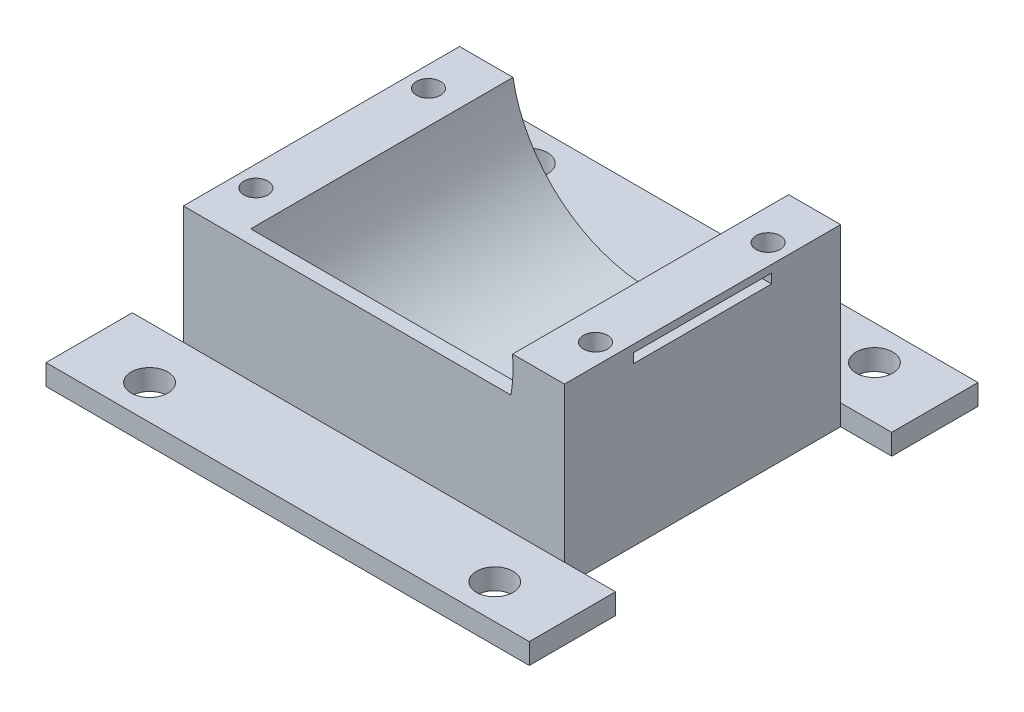
ISO-10303-21;
HEADER;
FILE_DESCRIPTION(('STEP AP214'),'2;1');
FILE_NAME('part.step','',(''),(''),'','','');
FILE_SCHEMA(('AUTOMOTIVE_DESIGN { 1 0 10303 214 1 1 1 1 }'));
ENDSEC;
DATA;
#1=APPLICATION_CONTEXT('core data for automotive mechanical design processes');
#2=APPLICATION_PROTOCOL_DEFINITION('international standard','automotive_design',2000,#1);
#3=PRODUCT_CONTEXT('',#1,'mechanical');
#4=PRODUCT('Part','Part','',(#3));
#5=PRODUCT_RELATED_PRODUCT_CATEGORY('part','',(#4));
#6=PRODUCT_DEFINITION_FORMATION('','',#4);
#7=PRODUCT_DEFINITION_CONTEXT('part definition',#1,'design');
#8=PRODUCT_DEFINITION('design','',#6,#7);
#9=PRODUCT_DEFINITION_SHAPE('','',#8);
#10=(LENGTH_UNIT() NAMED_UNIT(*) SI_UNIT(.MILLI.,.METRE.));
#11=(NAMED_UNIT(*) PLANE_ANGLE_UNIT() SI_UNIT($,.RADIAN.));
#12=(NAMED_UNIT(*) SI_UNIT($,.STERADIAN.) SOLID_ANGLE_UNIT());
#13=UNCERTAINTY_MEASURE_WITH_UNIT(LENGTH_MEASURE(1.E-05),#10,'distance_accuracy_value','');
#14=(GEOMETRIC_REPRESENTATION_CONTEXT(3) GLOBAL_UNCERTAINTY_ASSIGNED_CONTEXT((#13)) GLOBAL_UNIT_ASSIGNED_CONTEXT((#10,
#11,#12)) REPRESENTATION_CONTEXT('',''));
#15=CARTESIAN_POINT('',(0.,0.,0.));
#16=DIRECTION('',(0.,0.,1.));
#17=DIRECTION('',(1.,0.,0.));
#18=AXIS2_PLACEMENT_3D('',#15,#16,#17);
#19=CARTESIAN_POINT('',(0.,0.,-50.8));
#20=DIRECTION('',(0.,0.,1.));
#21=DIRECTION('',(1.,0.,0.));
#22=AXIS2_PLACEMENT_3D('',#19,#20,#21);
#23=PLANE('',#22);
#24=DIRECTION('',(1.,0.,0.));
#25=VECTOR('',#24,1.);
#26=CARTESIAN_POINT('',(-88.9,-52.324,-50.8));
#27=LINE('',#26,#25);
#28=CARTESIAN_POINT('',(-70.104,-52.324,-50.8));
#29=VERTEX_POINT('',#28);
#30=CARTESIAN_POINT('',(70.104,-52.324,-50.8));
#31=VERTEX_POINT('',#30);
#32=EDGE_CURVE('E11',#29,#31,#27,.T.);
#33=ORIENTED_EDGE('',*,*,#32,.F.);
#34=DIRECTION('',(0.,-1.,0.));
#35=VECTOR('',#34,1.);
#36=CARTESIAN_POINT('',(-70.104,0.,-50.8));
#37=LINE('',#36,#35);
#38=CARTESIAN_POINT('',(-70.104,-8.89148128126936,-50.8));
#39=VERTEX_POINT('',#38);
#40=EDGE_CURVE('E367',#39,#29,#37,.T.);
#41=ORIENTED_EDGE('',*,*,#40,.F.);
#42=DIRECTION('',(-1.,0.,0.));
#43=VECTOR('',#42,1.);
#44=CARTESIAN_POINT('',(0.,-8.89148128126934,-50.8));
#45=LINE('',#44,#43);
#46=CARTESIAN_POINT('',(-50.426096139936,-8.89148128126936,-50.8));
#47=VERTEX_POINT('',#46);
#48=EDGE_CURVE('E382',#47,#39,#45,.T.);
#49=ORIENTED_EDGE('',*,*,#48,.F.);
#50=CARTESIAN_POINT('',(0.,0.,-50.8));
#51=DIRECTION('',(0.,0.,1.));
#52=DIRECTION('',(1.,0.,0.));
#53=AXIS2_PLACEMENT_3D('',#50,#51,#52);
#54=CIRCLE('',#53,51.203999954);
#55=CARTESIAN_POINT('',(51.0091532752648,4.46272264764193,-50.8));
#56=VERTEX_POINT('',#55);
#57=EDGE_CURVE('E379',#47,#56,#54,.T.);
#58=ORIENTED_EDGE('',*,*,#57,.T.);
#59=DIRECTION('',(1.,0.,0.));
#60=VECTOR('',#59,1.);
#61=CARTESIAN_POINT('',(0.,4.46272264764193,-50.8));
#62=LINE('',#61,#60);
#63=CARTESIAN_POINT('',(70.104,4.46272264764193,-50.8));
#64=VERTEX_POINT('',#63);
#65=EDGE_CURVE('E376',#56,#64,#62,.T.);
#66=ORIENTED_EDGE('',*,*,#65,.T.);
#67=DIRECTION('',(0.,-1.,0.));
#68=VECTOR('',#67,1.);
#69=CARTESIAN_POINT('',(70.104,0.,-50.8));
#70=LINE('',#69,#68);
#71=EDGE_CURVE('E373',#64,#31,#70,.T.);
#72=ORIENTED_EDGE('',*,*,#71,.T.);
#73=EDGE_LOOP('',(#33,#41,#49,#58,#66,#72));
#74=FACE_BOUND('',#73,.T.);
#75=ADVANCED_FACE('F47',(#74),#23,.F.);
#76=CARTESIAN_POINT('',(0.,-52.324,0.));
#77=DIRECTION('',(0.,-1.,0.));
#78=DIRECTION('',(0.,0.,-1.));
#79=AXIS2_PLACEMENT_3D('',#76,#77,#78);
#80=PLANE('',#79);
#81=CARTESIAN_POINT('',(-63.5,-52.324,69.85));
#82=DIRECTION('',(0.,1.,0.));
#83=DIRECTION('',(0.,0.,1.));
#84=AXIS2_PLACEMENT_3D('',#81,#82,#83);
#85=CIRCLE('',#84,6.74623999999999);
#86=CARTESIAN_POINT('',(-63.5,-52.324,76.59624));
#87=VERTEX_POINT('',#86);
#88=EDGE_CURVE('E292',#87,#87,#85,.T.);
#89=ORIENTED_EDGE('',*,*,#88,.F.);
#90=EDGE_LOOP('',(#89));
#91=FACE_BOUND('',#90,.T.);
#92=DIRECTION('',(0.,0.,-1.));
#93=VECTOR('',#92,1.);
#94=CARTESIAN_POINT('',(-88.9,-52.324,82.55));
#95=LINE('',#94,#93);
#96=CARTESIAN_POINT('',(-88.9,-52.324,82.55));
#97=VERTEX_POINT('',#96);
#98=CARTESIAN_POINT('',(-88.9,-52.324,50.8));
#99=VERTEX_POINT('',#98);
#100=EDGE_CURVE('E320',#97,#99,#95,.T.);
#101=ORIENTED_EDGE('',*,*,#100,.F.);
#102=DIRECTION('',(-1.,0.,0.));
#103=VECTOR('',#102,1.);
#104=CARTESIAN_POINT('',(-88.9,-52.324,82.55));
#105=LINE('',#104,#103);
#106=CARTESIAN_POINT('',(88.9,-52.324,82.55));
#107=VERTEX_POINT('',#106);
#108=EDGE_CURVE('E334',#107,#97,#105,.T.);
#109=ORIENTED_EDGE('',*,*,#108,.F.);
#110=DIRECTION('',(0.,0.,1.));
#111=VECTOR('',#110,1.);
#112=CARTESIAN_POINT('',(88.9,-52.324,82.55));
#113=LINE('',#112,#111);
#114=CARTESIAN_POINT('',(88.9,-52.324,50.8));
#115=VERTEX_POINT('',#114);
#116=EDGE_CURVE('E330',#115,#107,#113,.T.);
#117=ORIENTED_EDGE('',*,*,#116,.F.);
#118=DIRECTION('',(1.,0.,0.));
#119=VECTOR('',#118,1.);
#120=CARTESIAN_POINT('',(-88.9,-52.324,50.8));
#121=LINE('',#120,#119);
#122=CARTESIAN_POINT('',(70.104,-52.324,50.8));
#123=VERTEX_POINT('',#122);
#124=EDGE_CURVE('E324',#123,#115,#121,.T.);
#125=ORIENTED_EDGE('',*,*,#124,.F.);
#126=CARTESIAN_POINT('',(-70.104,-52.324,50.8));
#127=VERTEX_POINT('',#126);
#128=EDGE_CURVE('E57',#127,#123,#121,.T.);
#129=ORIENTED_EDGE('',*,*,#128,.F.);
#130=EDGE_CURVE('E326',#99,#127,#121,.T.);
#131=ORIENTED_EDGE('',*,*,#130,.F.);
#132=EDGE_LOOP('',(#101,#109,#117,#125,#129,#131));
#133=FACE_BOUND('',#132,.T.);
#134=CARTESIAN_POINT('',(63.5,-52.324,69.85));
#135=DIRECTION('',(0.,1.,0.));
#136=DIRECTION('',(0.,0.,1.));
#137=AXIS2_PLACEMENT_3D('',#134,#135,#136);
#138=CIRCLE('',#137,6.74623999999999);
#139=CARTESIAN_POINT('',(63.5,-52.324,76.59624));
#140=VERTEX_POINT('',#139);
#141=EDGE_CURVE('E311',#140,#140,#138,.T.);
#142=ORIENTED_EDGE('',*,*,#141,.F.);
#143=EDGE_LOOP('',(#142));
#144=FACE_BOUND('',#143,.T.);
#145=ADVANCED_FACE('F481',(#91,#133,#144),#80,.F.);
#146=CARTESIAN_POINT('',(0.,-59.944,-50.8));
#147=DIRECTION('',(0.,-1.,0.));
#148=DIRECTION('',(0.,0.,-1.));
#149=AXIS2_PLACEMENT_3D('',#146,#147,#148);
#150=PLANE('',#149);
#151=CARTESIAN_POINT('',(-62.484,-59.944,-31.75));
#152=DIRECTION('',(0.,1.,0.));
#153=DIRECTION('',(0.,0.,1.));
#154=AXIS2_PLACEMENT_3D('',#151,#152,#153);
#155=CIRCLE('',#154,4.4323);
#156=CARTESIAN_POINT('',(-62.484,-59.944,-27.3177));
#157=VERTEX_POINT('',#156);
#158=EDGE_CURVE('E539',#157,#157,#155,.T.);
#159=ORIENTED_EDGE('',*,*,#158,.T.);
#160=EDGE_LOOP('',(#159));
#161=FACE_BOUND('',#160,.T.);
#162=CARTESIAN_POINT('',(-62.484,-59.944,31.75));
#163=DIRECTION('',(0.,1.,0.));
#164=DIRECTION('',(0.,0.,1.));
#165=AXIS2_PLACEMENT_3D('',#162,#163,#164);
#166=CIRCLE('',#165,4.4323);
#167=CARTESIAN_POINT('',(-62.484,-59.944,36.1823));
#168=VERTEX_POINT('',#167);
#169=EDGE_CURVE('E543',#168,#168,#166,.T.);
#170=ORIENTED_EDGE('',*,*,#169,.T.);
#171=EDGE_LOOP('',(#170));
#172=FACE_BOUND('',#171,.T.);
#173=CARTESIAN_POINT('',(62.484,-59.944,-31.75));
#174=DIRECTION('',(0.,1.,0.));
#175=DIRECTION('',(-1.,0.,0.));
#176=AXIS2_PLACEMENT_3D('',#173,#174,#175);
#177=CIRCLE('',#176,4.4323);
#178=CARTESIAN_POINT('',(58.0517,-59.944,-31.75));
#179=VERTEX_POINT('',#178);
#180=EDGE_CURVE('E233',#179,#179,#177,.T.);
#181=ORIENTED_EDGE('',*,*,#180,.T.);
#182=EDGE_LOOP('',(#181));
#183=FACE_BOUND('',#182,.T.);
#184=CARTESIAN_POINT('',(62.484,-59.944,31.75));
#185=DIRECTION('',(0.,1.,0.));
#186=DIRECTION('',(-1.,0.,0.));
#187=AXIS2_PLACEMENT_3D('',#184,#185,#186);
#188=CIRCLE('',#187,4.4323);
#189=CARTESIAN_POINT('',(58.0517,-59.944,31.75));
#190=VERTEX_POINT('',#189);
#191=EDGE_CURVE('E550',#190,#190,#188,.T.);
#192=ORIENTED_EDGE('',*,*,#191,.T.);
#193=EDGE_LOOP('',(#192));
#194=FACE_BOUND('',#193,.T.);
#195=CARTESIAN_POINT('',(-63.5,-59.944,-69.85));
#196=DIRECTION('',(0.,1.,0.));
#197=DIRECTION('',(0.,0.,1.));
#198=AXIS2_PLACEMENT_3D('',#195,#196,#197);
#199=CIRCLE('',#198,6.74624);
#200=CARTESIAN_POINT('',(-63.5,-59.944,-63.10376));
#201=VERTEX_POINT('',#200);
#202=EDGE_CURVE('E248',#201,#201,#199,.T.);
#203=ORIENTED_EDGE('',*,*,#202,.T.);
#204=EDGE_LOOP('',(#203));
#205=FACE_BOUND('',#204,.T.);
#206=CARTESIAN_POINT('',(63.5,-59.944,-69.85));
#207=DIRECTION('',(0.,1.,0.));
#208=DIRECTION('',(0.,0.,1.));
#209=AXIS2_PLACEMENT_3D('',#206,#207,#208);
#210=CIRCLE('',#209,6.74624);
#211=CARTESIAN_POINT('',(63.5,-59.944,-63.10376));
#212=VERTEX_POINT('',#211);
#213=EDGE_CURVE('E256',#212,#212,#210,.T.);
#214=ORIENTED_EDGE('',*,*,#213,.T.);
#215=EDGE_LOOP('',(#214));
#216=FACE_BOUND('',#215,.T.);
#217=CARTESIAN_POINT('',(-63.5,-59.944,69.85));
#218=DIRECTION('',(0.,1.,0.));
#219=DIRECTION('',(0.,0.,1.));
#220=AXIS2_PLACEMENT_3D('',#217,#218,#219);
#221=CIRCLE('',#220,6.74624);
#222=CARTESIAN_POINT('',(-63.5,-59.944,76.59624));
#223=VERTEX_POINT('',#222);
#224=EDGE_CURVE('E307',#223,#223,#221,.T.);
#225=ORIENTED_EDGE('',*,*,#224,.T.);
#226=EDGE_LOOP('',(#225));
#227=FACE_BOUND('',#226,.T.);
#228=DIRECTION('',(0.,0.,1.));
#229=VECTOR('',#228,1.);
#230=CARTESIAN_POINT('',(70.104,-59.944,-50.8));
#231=LINE('',#230,#229);
#232=CARTESIAN_POINT('',(70.104,-59.944,-50.8));
#233=VERTEX_POINT('',#232);
#234=CARTESIAN_POINT('',(70.104,-59.944,50.8));
#235=VERTEX_POINT('',#234);
#236=EDGE_CURVE('E417',#233,#235,#231,.T.);
#237=ORIENTED_EDGE('',*,*,#236,.T.);
#238=DIRECTION('',(1.,0.,0.));
#239=VECTOR('',#238,1.);
#240=CARTESIAN_POINT('',(-88.9,-59.944,50.8));
#241=LINE('',#240,#239);
#242=CARTESIAN_POINT('',(88.9,-59.944,50.8));
#243=VERTEX_POINT('',#242);
#244=EDGE_CURVE('E342',#235,#243,#241,.T.);
#245=ORIENTED_EDGE('',*,*,#244,.T.);
#246=DIRECTION('',(0.,0.,1.));
#247=VECTOR('',#246,1.);
#248=CARTESIAN_POINT('',(88.9,-59.944,82.55));
#249=LINE('',#248,#247);
#250=CARTESIAN_POINT('',(88.9,-59.944,82.55));
#251=VERTEX_POINT('',#250);
#252=EDGE_CURVE('E347',#243,#251,#249,.T.);
#253=ORIENTED_EDGE('',*,*,#252,.T.);
#254=DIRECTION('',(-1.,0.,0.));
#255=VECTOR('',#254,1.);
#256=CARTESIAN_POINT('',(-88.9,-59.944,82.55));
#257=LINE('',#256,#255);
#258=CARTESIAN_POINT('',(-88.9,-59.944,82.55));
#259=VERTEX_POINT('',#258);
#260=EDGE_CURVE('E325',#251,#259,#257,.T.);
#261=ORIENTED_EDGE('',*,*,#260,.T.);
#262=DIRECTION('',(0.,0.,-1.));
#263=VECTOR('',#262,1.);
#264=CARTESIAN_POINT('',(-88.9,-59.944,82.55));
#265=LINE('',#264,#263);
#266=CARTESIAN_POINT('',(-88.9,-59.944,50.8));
#267=VERTEX_POINT('',#266);
#268=EDGE_CURVE('E319',#259,#267,#265,.T.);
#269=ORIENTED_EDGE('',*,*,#268,.T.);
#270=CARTESIAN_POINT('',(-70.104,-59.944,50.8));
#271=VERTEX_POINT('',#270);
#272=EDGE_CURVE('E343',#267,#271,#241,.T.);
#273=ORIENTED_EDGE('',*,*,#272,.T.);
#274=DIRECTION('',(0.,0.,1.));
#275=VECTOR('',#274,1.);
#276=CARTESIAN_POINT('',(-70.104,-59.944,-50.8));
#277=LINE('',#276,#275);
#278=CARTESIAN_POINT('',(-70.104,-59.944,-50.8));
#279=VERTEX_POINT('',#278);
#280=EDGE_CURVE('E51',#279,#271,#277,.T.);
#281=ORIENTED_EDGE('',*,*,#280,.F.);
#282=DIRECTION('',(1.,0.,0.));
#283=VECTOR('',#282,1.);
#284=CARTESIAN_POINT('',(-88.9,-59.944,-50.8));
#285=LINE('',#284,#283);
#286=CARTESIAN_POINT('',(-88.9,-59.944,-50.8));
#287=VERTEX_POINT('',#286);
#288=EDGE_CURVE('E266',#287,#279,#285,.T.);
#289=ORIENTED_EDGE('',*,*,#288,.F.);
#290=DIRECTION('',(0.,0.,1.));
#291=VECTOR('',#290,1.);
#292=CARTESIAN_POINT('',(-88.9,-59.944,-82.55));
#293=LINE('',#292,#291);
#294=CARTESIAN_POINT('',(-88.9,-59.944,-82.55));
#295=VERTEX_POINT('',#294);
#296=EDGE_CURVE('E260',#295,#287,#293,.T.);
#297=ORIENTED_EDGE('',*,*,#296,.F.);
#298=DIRECTION('',(-1.,0.,0.));
#299=VECTOR('',#298,1.);
#300=CARTESIAN_POINT('',(-88.9,-59.944,-82.55));
#301=LINE('',#300,#299);
#302=CARTESIAN_POINT('',(88.9,-59.944,-82.55));
#303=VERTEX_POINT('',#302);
#304=EDGE_CURVE('E278',#303,#295,#301,.T.);
#305=ORIENTED_EDGE('',*,*,#304,.F.);
#306=DIRECTION('',(0.,0.,-1.));
#307=VECTOR('',#306,1.);
#308=CARTESIAN_POINT('',(88.9,-59.944,-82.55));
#309=LINE('',#308,#307);
#310=CARTESIAN_POINT('',(88.9,-59.944,-50.8));
#311=VERTEX_POINT('',#310);
#312=EDGE_CURVE('E281',#311,#303,#309,.T.);
#313=ORIENTED_EDGE('',*,*,#312,.F.);
#314=EDGE_CURVE('E284',#233,#311,#285,.T.);
#315=ORIENTED_EDGE('',*,*,#314,.F.);
#316=EDGE_LOOP('',(#237,#245,#253,#261,#269,#273,#281,#289,#297,#305,#313,#315));
#317=FACE_BOUND('',#316,.T.);
#318=CARTESIAN_POINT('',(63.5,-59.944,69.85));
#319=DIRECTION('',(0.,1.,0.));
#320=DIRECTION('',(0.,0.,1.));
#321=AXIS2_PLACEMENT_3D('',#318,#319,#320);
#322=CIRCLE('',#321,6.74624);
#323=CARTESIAN_POINT('',(63.5,-59.944,76.59624));
#324=VERTEX_POINT('',#323);
#325=EDGE_CURVE('E315',#324,#324,#322,.T.);
#326=ORIENTED_EDGE('',*,*,#325,.T.);
#327=EDGE_LOOP('',(#326));
#328=FACE_BOUND('',#327,.T.);
#329=ADVANCED_FACE('F429',(#161,#172,#183,#194,#205,#216,#227,#317,#328),#150,.T.);
#330=CARTESIAN_POINT('',(0.,0.,50.8));
#331=DIRECTION('',(0.,0.,1.));
#332=DIRECTION('',(1.,0.,0.));
#333=AXIS2_PLACEMENT_3D('',#330,#331,#332);
#334=PLANE('',#333);
#335=CARTESIAN_POINT('',(0.,0.,50.8));
#336=DIRECTION('',(0.,0.,1.));
#337=DIRECTION('',(1.,0.,0.));
#338=AXIS2_PLACEMENT_3D('',#335,#336,#337);
#339=CIRCLE('',#338,51.203999954);
#340=CARTESIAN_POINT('',(50.426096139936,-8.89148128126936,50.8));
#341=VERTEX_POINT('',#340);
#342=CARTESIAN_POINT('',(51.0091532752648,4.46272264764193,50.8));
#343=VERTEX_POINT('',#342);
#344=EDGE_CURVE('E397',#341,#343,#339,.T.);
#345=ORIENTED_EDGE('',*,*,#344,.F.);
#346=DIRECTION('',(-1.,0.,0.));
#347=VECTOR('',#346,1.);
#348=CARTESIAN_POINT('',(0.,-8.89148128126934,50.8));
#349=LINE('',#348,#347);
#350=CARTESIAN_POINT('',(-70.104,-8.89148128126936,50.8));
#351=VERTEX_POINT('',#350);
#352=EDGE_CURVE('E400',#341,#351,#349,.T.);
#353=ORIENTED_EDGE('',*,*,#352,.T.);
#354=DIRECTION('',(0.,-1.,0.));
#355=VECTOR('',#354,1.);
#356=CARTESIAN_POINT('',(-70.104,0.,50.8));
#357=LINE('',#356,#355);
#358=EDGE_CURVE('E386',#351,#127,#357,.T.);
#359=ORIENTED_EDGE('',*,*,#358,.T.);
#360=ORIENTED_EDGE('',*,*,#128,.T.);
#361=DIRECTION('',(0.,-1.,0.));
#362=VECTOR('',#361,1.);
#363=CARTESIAN_POINT('',(70.104,0.,50.8));
#364=LINE('',#363,#362);
#365=CARTESIAN_POINT('',(70.104,4.46272264764193,50.8));
#366=VERTEX_POINT('',#365);
#367=EDGE_CURVE('E391',#366,#123,#364,.T.);
#368=ORIENTED_EDGE('',*,*,#367,.F.);
#369=DIRECTION('',(1.,0.,0.));
#370=VECTOR('',#369,1.);
#371=CARTESIAN_POINT('',(0.,4.46272264764193,50.8));
#372=LINE('',#371,#370);
#373=EDGE_CURVE('E394',#343,#366,#372,.T.);
#374=ORIENTED_EDGE('',*,*,#373,.F.);
#375=EDGE_LOOP('',(#345,#353,#359,#360,#368,#374));
#376=FACE_BOUND('',#375,.T.);
#377=ADVANCED_FACE('F475',(#376),#334,.T.);
#378=CARTESIAN_POINT('',(-70.104,0.,-50.8));
#379=DIRECTION('',(-1.,0.,0.));
#380=DIRECTION('',(0.,0.,1.));
#381=AXIS2_PLACEMENT_3D('',#378,#379,#380);
#382=PLANE('',#381);
#383=EDGE_CURVE('E357',#127,#271,#357,.T.);
#384=ORIENTED_EDGE('',*,*,#383,.F.);
#385=ORIENTED_EDGE('',*,*,#358,.F.);
#386=DIRECTION('',(0.,0.,1.));
#387=VECTOR('',#386,1.);
#388=CARTESIAN_POINT('',(-70.104,-8.89148128126936,-50.8));
#389=LINE('',#388,#387);
#390=EDGE_CURVE('E404',#39,#351,#389,.T.);
#391=ORIENTED_EDGE('',*,*,#390,.F.);
#392=ORIENTED_EDGE('',*,*,#40,.T.);
#393=EDGE_CURVE('E372',#29,#279,#37,.T.);
#394=ORIENTED_EDGE('',*,*,#393,.T.);
#395=ORIENTED_EDGE('',*,*,#280,.T.);
#396=EDGE_LOOP('',(#384,#385,#391,#392,#394,#395));
#397=FACE_BOUND('',#396,.T.);
#398=ADVANCED_FACE('F49',(#397),#382,.T.);
#399=CARTESIAN_POINT('',(0.,-8.89148128126934,-50.8));
#400=DIRECTION('',(0.,1.,0.));
#401=DIRECTION('',(-1.,0.,0.));
#402=AXIS2_PLACEMENT_3D('',#399,#400,#401);
#403=PLANE('',#402);
#404=CARTESIAN_POINT('',(-62.484,-8.89148128126934,-31.75));
#405=DIRECTION('',(0.,1.,0.));
#406=DIRECTION('',(0.,0.,1.));
#407=AXIS2_PLACEMENT_3D('',#404,#405,#406);
#408=CIRCLE('',#407,4.4323);
#409=CARTESIAN_POINT('',(-62.484,-8.89148128126934,-27.3177));
#410=VERTEX_POINT('',#409);
#411=EDGE_CURVE('E621',#410,#410,#408,.T.);
#412=ORIENTED_EDGE('',*,*,#411,.F.);
#413=EDGE_LOOP('',(#412));
#414=FACE_BOUND('',#413,.T.);
#415=CARTESIAN_POINT('',(-62.484,-8.89148128126934,31.75));
#416=DIRECTION('',(0.,1.,0.));
#417=DIRECTION('',(0.,0.,1.));
#418=AXIS2_PLACEMENT_3D('',#415,#416,#417);
#419=CIRCLE('',#418,4.4323);
#420=CARTESIAN_POINT('',(-62.484,-8.89148128126934,36.1823));
#421=VERTEX_POINT('',#420);
#422=EDGE_CURVE('E623',#421,#421,#419,.T.);
#423=ORIENTED_EDGE('',*,*,#422,.F.);
#424=EDGE_LOOP('',(#423));
#425=FACE_BOUND('',#424,.T.);
#426=ORIENTED_EDGE('',*,*,#390,.T.);
#427=ORIENTED_EDGE('',*,*,#352,.F.);
#428=DIRECTION('',(0.,0.,1.));
#429=VECTOR('',#428,1.);
#430=CARTESIAN_POINT('',(50.426096139936,-8.89148128126936,-50.8));
#431=LINE('',#430,#429);
#432=CARTESIAN_POINT('',(50.426096139936,-8.89148128126936,45.72));
#433=VERTEX_POINT('',#432);
#434=EDGE_CURVE('E240',#433,#341,#431,.T.);
#435=ORIENTED_EDGE('',*,*,#434,.F.);
#436=DIRECTION('',(-1.,0.,0.));
#437=VECTOR('',#436,1.);
#438=CARTESIAN_POINT('',(-70.104,-8.89148128126936,45.72));
#439=LINE('',#438,#437);
#440=CARTESIAN_POINT('',(-50.426096139936,-8.89148128126936,45.72));
#441=VERTEX_POINT('',#440);
#442=EDGE_CURVE('E220',#433,#441,#439,.T.);
#443=ORIENTED_EDGE('',*,*,#442,.T.);
#444=DIRECTION('',(0.,0.,1.));
#445=VECTOR('',#444,1.);
#446=CARTESIAN_POINT('',(-50.426096139936,-8.89148128126936,-50.8));
#447=LINE('',#446,#445);
#448=EDGE_CURVE('E407',#47,#441,#447,.T.);
#449=ORIENTED_EDGE('',*,*,#448,.F.);
#450=ORIENTED_EDGE('',*,*,#48,.T.);
#451=EDGE_LOOP('',(#426,#427,#435,#443,#449,#450));
#452=FACE_BOUND('',#451,.T.);
#453=ADVANCED_FACE('F519',(#414,#425,#452),#403,.T.);
#454=CARTESIAN_POINT('',(0.,0.,-50.8));
#455=DIRECTION('',(0.,0.,1.));
#456=DIRECTION('',(1.,0.,0.));
#457=AXIS2_PLACEMENT_3D('',#454,#455,#456);
#458=CYLINDRICAL_SURFACE('',#457,51.203999954);
#459=DIRECTION('',(0.,0.,1.));
#460=VECTOR('',#459,1.);
#461=CARTESIAN_POINT('',(51.1745122614674,1.73749995400003,-50.8));
#462=LINE('',#461,#460);
#463=CARTESIAN_POINT('',(51.1745122614674,1.73749995400001,25.4));
#464=VERTEX_POINT('',#463);
#465=CARTESIAN_POINT('',(51.1745122614674,1.73749995400002,-25.4));
#466=VERTEX_POINT('',#465);
#467=EDGE_CURVE('E199',#464,#466,#462,.F.);
#468=ORIENTED_EDGE('',*,*,#467,.F.);
#469=CARTESIAN_POINT('',(0.,0.,25.4));
#470=DIRECTION('',(0.,0.,1.));
#471=DIRECTION('',(1.,0.,0.));
#472=AXIS2_PLACEMENT_3D('',#469,#470,#471);
#473=CIRCLE('',#472,51.203999954);
#474=CARTESIAN_POINT('',(51.1745122614674,-1.737499954,25.4));
#475=VERTEX_POINT('',#474);
#476=EDGE_CURVE('E207',#475,#464,#473,.T.);
#477=ORIENTED_EDGE('',*,*,#476,.F.);
#478=DIRECTION('',(0.,0.,1.));
#479=VECTOR('',#478,1.);
#480=CARTESIAN_POINT('',(51.1745122614674,-1.737499954,-50.8));
#481=LINE('',#480,#479);
#482=CARTESIAN_POINT('',(51.1745122614674,-1.737499954,-25.4));
#483=VERTEX_POINT('',#482);
#484=EDGE_CURVE('E213',#483,#475,#481,.T.);
#485=ORIENTED_EDGE('',*,*,#484,.F.);
#486=CARTESIAN_POINT('',(0.,0.,-25.4));
#487=DIRECTION('',(0.,0.,-1.));
#488=DIRECTION('',(-1.,0.,0.));
#489=AXIS2_PLACEMENT_3D('',#486,#487,#488);
#490=CIRCLE('',#489,51.203999954);
#491=EDGE_CURVE('E67',#466,#483,#490,.T.);
#492=ORIENTED_EDGE('',*,*,#491,.F.);
#493=EDGE_LOOP('',(#468,#477,#485,#492));
#494=FACE_BOUND('',#493,.T.);
#495=CARTESIAN_POINT('',(0.,0.,45.72));
#496=DIRECTION('',(0.,0.,-1.));
#497=DIRECTION('',(-1.,0.,0.));
#498=AXIS2_PLACEMENT_3D('',#495,#496,#497);
#499=CIRCLE('',#498,51.203999954);
#500=EDGE_CURVE('E237',#441,#433,#499,.F.);
#501=ORIENTED_EDGE('',*,*,#500,.T.);
#502=ORIENTED_EDGE('',*,*,#434,.T.);
#503=ORIENTED_EDGE('',*,*,#344,.T.);
#504=DIRECTION('',(0.,0.,1.));
#505=VECTOR('',#504,1.);
#506=CARTESIAN_POINT('',(51.0091532752648,4.46272264764193,-50.8));
#507=LINE('',#506,#505);
#508=EDGE_CURVE('E410',#56,#343,#507,.T.);
#509=ORIENTED_EDGE('',*,*,#508,.F.);
#510=ORIENTED_EDGE('',*,*,#57,.F.);
#511=ORIENTED_EDGE('',*,*,#448,.T.);
#512=EDGE_LOOP('',(#501,#502,#503,#509,#510,#511));
#513=FACE_BOUND('',#512,.T.);
#514=ADVANCED_FACE('F215',(#494,#513),#458,.F.);
#515=CARTESIAN_POINT('',(0.,4.46272264764193,-50.8));
#516=DIRECTION('',(0.,-1.,0.));
#517=DIRECTION('',(0.,0.,-1.));
#518=AXIS2_PLACEMENT_3D('',#515,#516,#517);
#519=PLANE('',#518);
#520=CARTESIAN_POINT('',(62.484,4.46272264764192,-31.75));
#521=DIRECTION('',(0.,1.,0.));
#522=DIRECTION('',(-1.,0.,0.));
#523=AXIS2_PLACEMENT_3D('',#520,#521,#522);
#524=CIRCLE('',#523,4.4323);
#525=CARTESIAN_POINT('',(58.0517,4.46272264764192,-31.75));
#526=VERTEX_POINT('',#525);
#527=EDGE_CURVE('E635',#526,#526,#524,.T.);
#528=ORIENTED_EDGE('',*,*,#527,.F.);
#529=EDGE_LOOP('',(#528));
#530=FACE_BOUND('',#529,.T.);
#531=CARTESIAN_POINT('',(62.484,4.46272264764192,31.75));
#532=DIRECTION('',(0.,1.,0.));
#533=DIRECTION('',(-1.,0.,0.));
#534=AXIS2_PLACEMENT_3D('',#531,#532,#533);
#535=CIRCLE('',#534,4.4323);
#536=CARTESIAN_POINT('',(58.0517,4.46272264764192,31.75));
#537=VERTEX_POINT('',#536);
#538=EDGE_CURVE('E639',#537,#537,#535,.T.);
#539=ORIENTED_EDGE('',*,*,#538,.F.);
#540=EDGE_LOOP('',(#539));
#541=FACE_BOUND('',#540,.T.);
#542=ORIENTED_EDGE('',*,*,#373,.T.);
#543=DIRECTION('',(0.,0.,1.));
#544=VECTOR('',#543,1.);
#545=CARTESIAN_POINT('',(70.104,4.46272264764193,-50.8));
#546=LINE('',#545,#544);
#547=EDGE_CURVE('E414',#64,#366,#546,.T.);
#548=ORIENTED_EDGE('',*,*,#547,.F.);
#549=ORIENTED_EDGE('',*,*,#65,.F.);
#550=ORIENTED_EDGE('',*,*,#508,.T.);
#551=EDGE_LOOP('',(#542,#548,#549,#550));
#552=FACE_BOUND('',#551,.T.);
#553=ADVANCED_FACE('F525',(#530,#541,#552),#519,.F.);
#554=CARTESIAN_POINT('',(70.104,0.,-50.8));
#555=DIRECTION('',(-1.,0.,0.));
#556=DIRECTION('',(0.,-1.,0.));
#557=AXIS2_PLACEMENT_3D('',#554,#555,#556);
#558=PLANE('',#557);
#559=DIRECTION('',(0.,0.,-1.));
#560=VECTOR('',#559,1.);
#561=CARTESIAN_POINT('',(70.104,-1.73749995399998,25.4));
#562=LINE('',#561,#560);
#563=CARTESIAN_POINT('',(70.104,-1.73749995399998,25.4));
#564=VERTEX_POINT('',#563);
#565=CARTESIAN_POINT('',(70.104,-1.73749995399999,-25.4));
#566=VERTEX_POINT('',#565);
#567=EDGE_CURVE('E651',#564,#566,#562,.T.);
#568=ORIENTED_EDGE('',*,*,#567,.F.);
#569=DIRECTION('',(0.,-1.,0.));
#570=VECTOR('',#569,1.);
#571=CARTESIAN_POINT('',(70.104,1.73749995400002,25.4));
#572=LINE('',#571,#570);
#573=CARTESIAN_POINT('',(70.104,1.73749995400002,25.4));
#574=VERTEX_POINT('',#573);
#575=EDGE_CURVE('E75',#574,#564,#572,.T.);
#576=ORIENTED_EDGE('',*,*,#575,.F.);
#577=DIRECTION('',(0.,0.,1.));
#578=VECTOR('',#577,1.);
#579=CARTESIAN_POINT('',(70.104,1.73749995400002,25.4));
#580=LINE('',#579,#578);
#581=CARTESIAN_POINT('',(70.104,1.73749995400002,-25.4));
#582=VERTEX_POINT('',#581);
#583=EDGE_CURVE('E201',#582,#574,#580,.T.);
#584=ORIENTED_EDGE('',*,*,#583,.F.);
#585=DIRECTION('',(0.,1.,0.));
#586=VECTOR('',#585,1.);
#587=CARTESIAN_POINT('',(70.104,1.73749995400002,-25.4));
#588=LINE('',#587,#586);
#589=EDGE_CURVE('E647',#566,#582,#588,.T.);
#590=ORIENTED_EDGE('',*,*,#589,.F.);
#591=EDGE_LOOP('',(#568,#576,#584,#590));
#592=FACE_BOUND('',#591,.T.);
#593=ORIENTED_EDGE('',*,*,#367,.T.);
#594=EDGE_CURVE('E390',#123,#235,#364,.T.);
#595=ORIENTED_EDGE('',*,*,#594,.T.);
#596=ORIENTED_EDGE('',*,*,#236,.F.);
#597=EDGE_CURVE('E371',#31,#233,#70,.T.);
#598=ORIENTED_EDGE('',*,*,#597,.F.);
#599=ORIENTED_EDGE('',*,*,#71,.F.);
#600=ORIENTED_EDGE('',*,*,#547,.T.);
#601=EDGE_LOOP('',(#593,#595,#596,#598,#599,#600));
#602=FACE_BOUND('',#601,.T.);
#603=ADVANCED_FACE('F466',(#592,#602),#558,.F.);
#604=CARTESIAN_POINT('',(-88.9,-52.324,50.8));
#605=DIRECTION('',(0.,0.,-1.));
#606=DIRECTION('',(-1.,0.,0.));
#607=AXIS2_PLACEMENT_3D('',#604,#605,#606);
#608=PLANE('',#607);
#609=ORIENTED_EDGE('',*,*,#594,.F.);
#610=ORIENTED_EDGE('',*,*,#124,.T.);
#611=DIRECTION('',(0.,-1.,0.));
#612=VECTOR('',#611,1.);
#613=CARTESIAN_POINT('',(88.9,-52.324,50.8));
#614=LINE('',#613,#612);
#615=EDGE_CURVE('E361',#115,#243,#614,.T.);
#616=ORIENTED_EDGE('',*,*,#615,.T.);
#617=ORIENTED_EDGE('',*,*,#244,.F.);
#618=EDGE_LOOP('',(#609,#610,#616,#617));
#619=FACE_BOUND('',#618,.T.);
#620=ADVANCED_FACE('F471',(#619),#608,.T.);
#621=CARTESIAN_POINT('',(-88.9,-52.324,82.55));
#622=DIRECTION('',(-1.,0.,0.));
#623=DIRECTION('',(0.,0.,1.));
#624=AXIS2_PLACEMENT_3D('',#621,#622,#623);
#625=PLANE('',#624);
#626=ORIENTED_EDGE('',*,*,#268,.F.);
#627=DIRECTION('',(0.,-1.,0.));
#628=VECTOR('',#627,1.);
#629=CARTESIAN_POINT('',(-88.9,-52.324,82.55));
#630=LINE('',#629,#628);
#631=EDGE_CURVE('E354',#97,#259,#630,.T.);
#632=ORIENTED_EDGE('',*,*,#631,.F.);
#633=ORIENTED_EDGE('',*,*,#100,.T.);
#634=DIRECTION('',(0.,-1.,0.));
#635=VECTOR('',#634,1.);
#636=CARTESIAN_POINT('',(-88.9,-52.324,50.8));
#637=LINE('',#636,#635);
#638=EDGE_CURVE('E338',#99,#267,#637,.T.);
#639=ORIENTED_EDGE('',*,*,#638,.T.);
#640=EDGE_LOOP('',(#626,#632,#633,#639));
#641=FACE_BOUND('',#640,.T.);
#642=ADVANCED_FACE('F488',(#641),#625,.T.);
#643=CARTESIAN_POINT('',(-88.9,-52.324,82.55));
#644=DIRECTION('',(0.,0.,1.));
#645=DIRECTION('',(1.,0.,0.));
#646=AXIS2_PLACEMENT_3D('',#643,#644,#645);
#647=PLANE('',#646);
#648=ORIENTED_EDGE('',*,*,#260,.F.);
#649=DIRECTION('',(0.,-1.,0.));
#650=VECTOR('',#649,1.);
#651=CARTESIAN_POINT('',(88.9,-52.324,82.55));
#652=LINE('',#651,#650);
#653=EDGE_CURVE('E358',#107,#251,#652,.T.);
#654=ORIENTED_EDGE('',*,*,#653,.F.);
#655=ORIENTED_EDGE('',*,*,#108,.T.);
#656=ORIENTED_EDGE('',*,*,#631,.T.);
#657=EDGE_LOOP('',(#648,#654,#655,#656));
#658=FACE_BOUND('',#657,.T.);
#659=ADVANCED_FACE('F492',(#658),#647,.T.);
#660=CARTESIAN_POINT('',(88.9,-52.324,82.55));
#661=DIRECTION('',(1.,0.,0.));
#662=DIRECTION('',(0.,0.,-1.));
#663=AXIS2_PLACEMENT_3D('',#660,#661,#662);
#664=PLANE('',#663);
#665=ORIENTED_EDGE('',*,*,#252,.F.);
#666=ORIENTED_EDGE('',*,*,#615,.F.);
#667=ORIENTED_EDGE('',*,*,#116,.T.);
#668=ORIENTED_EDGE('',*,*,#653,.T.);
#669=EDGE_LOOP('',(#665,#666,#667,#668));
#670=FACE_BOUND('',#669,.T.);
#671=ADVANCED_FACE('F495',(#670),#664,.T.);
#672=ORIENTED_EDGE('',*,*,#130,.T.);
#673=ORIENTED_EDGE('',*,*,#383,.T.);
#674=ORIENTED_EDGE('',*,*,#272,.F.);
#675=ORIENTED_EDGE('',*,*,#638,.F.);
#676=EDGE_LOOP('',(#672,#673,#674,#675));
#677=FACE_BOUND('',#676,.T.);
#678=ADVANCED_FACE('F485',(#677),#608,.T.);
#679=CARTESIAN_POINT('',(63.5,-52.324,69.85));
#680=DIRECTION('',(0.,1.,0.));
#681=DIRECTION('',(0.,0.,1.));
#682=AXIS2_PLACEMENT_3D('',#679,#680,#681);
#683=CYLINDRICAL_SURFACE('',#682,6.74623999999999);
#684=ORIENTED_EDGE('',*,*,#325,.F.);
#685=EDGE_LOOP('',(#684));
#686=FACE_BOUND('',#685,.T.);
#687=ORIENTED_EDGE('',*,*,#141,.T.);
#688=EDGE_LOOP('',(#687));
#689=FACE_BOUND('',#688,.T.);
#690=ADVANCED_FACE('F502',(#686,#689),#683,.F.);
#691=CARTESIAN_POINT('',(-63.5,-52.324,69.85));
#692=DIRECTION('',(0.,1.,0.));
#693=DIRECTION('',(0.,0.,1.));
#694=AXIS2_PLACEMENT_3D('',#691,#692,#693);
#695=CYLINDRICAL_SURFACE('',#694,6.74623999999999);
#696=ORIENTED_EDGE('',*,*,#224,.F.);
#697=EDGE_LOOP('',(#696));
#698=FACE_BOUND('',#697,.T.);
#699=ORIENTED_EDGE('',*,*,#88,.T.);
#700=EDGE_LOOP('',(#699));
#701=FACE_BOUND('',#700,.T.);
#702=ADVANCED_FACE('F557',(#698,#701),#695,.F.);
#703=CARTESIAN_POINT('',(-88.9,-52.324,-50.8));
#704=DIRECTION('',(0.,0.,-1.));
#705=DIRECTION('',(-1.,0.,0.));
#706=AXIS2_PLACEMENT_3D('',#703,#704,#705);
#707=PLANE('',#706);
#708=CARTESIAN_POINT('',(88.9,-52.324,-50.8));
#709=VERTEX_POINT('',#708);
#710=EDGE_CURVE('E60',#31,#709,#27,.T.);
#711=ORIENTED_EDGE('',*,*,#710,.F.);
#712=ORIENTED_EDGE('',*,*,#597,.T.);
#713=ORIENTED_EDGE('',*,*,#314,.T.);
#714=DIRECTION('',(0.,-1.,0.));
#715=VECTOR('',#714,1.);
#716=CARTESIAN_POINT('',(88.9,-52.324,-50.8));
#717=LINE('',#716,#715);
#718=EDGE_CURVE('E293',#709,#311,#717,.T.);
#719=ORIENTED_EDGE('',*,*,#718,.F.);
#720=EDGE_LOOP('',(#711,#712,#713,#719));
#721=FACE_BOUND('',#720,.T.);
#722=ADVANCED_FACE('F452',(#721),#707,.F.);
#723=CARTESIAN_POINT('',(-88.9,-52.324,-82.55));
#724=DIRECTION('',(1.,0.,0.));
#725=DIRECTION('',(0.,0.,-1.));
#726=AXIS2_PLACEMENT_3D('',#723,#724,#725);
#727=PLANE('',#726);
#728=ORIENTED_EDGE('',*,*,#296,.T.);
#729=DIRECTION('',(0.,-1.,0.));
#730=VECTOR('',#729,1.);
#731=CARTESIAN_POINT('',(-88.9,-52.324,-50.8));
#732=LINE('',#731,#730);
#733=CARTESIAN_POINT('',(-88.9,-52.324,-50.8));
#734=VERTEX_POINT('',#733);
#735=EDGE_CURVE('E288',#734,#287,#732,.T.);
#736=ORIENTED_EDGE('',*,*,#735,.F.);
#737=DIRECTION('',(0.,0.,1.));
#738=VECTOR('',#737,1.);
#739=CARTESIAN_POINT('',(-88.9,-52.324,-82.55));
#740=LINE('',#739,#738);
#741=CARTESIAN_POINT('',(-88.9,-52.324,-82.55));
#742=VERTEX_POINT('',#741);
#743=EDGE_CURVE('E261',#742,#734,#740,.T.);
#744=ORIENTED_EDGE('',*,*,#743,.F.);
#745=DIRECTION('',(0.,-1.,0.));
#746=VECTOR('',#745,1.);
#747=CARTESIAN_POINT('',(-88.9,-52.324,-82.55));
#748=LINE('',#747,#746);
#749=EDGE_CURVE('E274',#742,#295,#748,.T.);
#750=ORIENTED_EDGE('',*,*,#749,.T.);
#751=EDGE_LOOP('',(#728,#736,#744,#750));
#752=FACE_BOUND('',#751,.T.);
#753=ADVANCED_FACE('F438',(#752),#727,.F.);
#754=ORIENTED_EDGE('',*,*,#393,.F.);
#755=EDGE_CURVE('E59',#734,#29,#27,.T.);
#756=ORIENTED_EDGE('',*,*,#755,.F.);
#757=ORIENTED_EDGE('',*,*,#735,.T.);
#758=ORIENTED_EDGE('',*,*,#288,.T.);
#759=EDGE_LOOP('',(#754,#756,#757,#758));
#760=FACE_BOUND('',#759,.T.);
#761=ADVANCED_FACE('F434',(#760),#707,.F.);
#762=CARTESIAN_POINT('',(88.9,-52.324,-82.55));
#763=DIRECTION('',(-1.,0.,0.));
#764=DIRECTION('',(0.,0.,1.));
#765=AXIS2_PLACEMENT_3D('',#762,#763,#764);
#766=PLANE('',#765);
#767=ORIENTED_EDGE('',*,*,#312,.T.);
#768=DIRECTION('',(0.,-1.,0.));
#769=VECTOR('',#768,1.);
#770=CARTESIAN_POINT('',(88.9,-52.324,-82.55));
#771=LINE('',#770,#769);
#772=CARTESIAN_POINT('',(88.9,-52.324,-82.55));
#773=VERTEX_POINT('',#772);
#774=EDGE_CURVE('E297',#773,#303,#771,.T.);
#775=ORIENTED_EDGE('',*,*,#774,.F.);
#776=DIRECTION('',(0.,0.,-1.));
#777=VECTOR('',#776,1.);
#778=CARTESIAN_POINT('',(88.9,-52.324,-82.55));
#779=LINE('',#778,#777);
#780=EDGE_CURVE('E269',#709,#773,#779,.T.);
#781=ORIENTED_EDGE('',*,*,#780,.F.);
#782=ORIENTED_EDGE('',*,*,#718,.T.);
#783=EDGE_LOOP('',(#767,#775,#781,#782));
#784=FACE_BOUND('',#783,.T.);
#785=ADVANCED_FACE('F448',(#784),#766,.F.);
#786=CARTESIAN_POINT('',(-88.9,-52.324,-82.55));
#787=DIRECTION('',(0.,0.,1.));
#788=DIRECTION('',(1.,0.,0.));
#789=AXIS2_PLACEMENT_3D('',#786,#787,#788);
#790=PLANE('',#789);
#791=ORIENTED_EDGE('',*,*,#304,.T.);
#792=ORIENTED_EDGE('',*,*,#749,.F.);
#793=DIRECTION('',(-1.,0.,0.));
#794=VECTOR('',#793,1.);
#795=CARTESIAN_POINT('',(-88.9,-52.324,-82.55));
#796=LINE('',#795,#794);
#797=EDGE_CURVE('E265',#773,#742,#796,.T.);
#798=ORIENTED_EDGE('',*,*,#797,.F.);
#799=ORIENTED_EDGE('',*,*,#774,.T.);
#800=EDGE_LOOP('',(#791,#792,#798,#799));
#801=FACE_BOUND('',#800,.T.);
#802=ADVANCED_FACE('F443',(#801),#790,.F.);
#803=CARTESIAN_POINT('',(0.,-52.324,0.));
#804=DIRECTION('',(0.,-1.,0.));
#805=DIRECTION('',(0.,0.,1.));
#806=AXIS2_PLACEMENT_3D('',#803,#804,#805);
#807=PLANE('',#806);
#808=CARTESIAN_POINT('',(-63.5,-52.324,-69.85));
#809=DIRECTION('',(0.,1.,0.));
#810=DIRECTION('',(0.,0.,1.));
#811=AXIS2_PLACEMENT_3D('',#808,#809,#810);
#812=CIRCLE('',#811,6.74623999999999);
#813=CARTESIAN_POINT('',(-63.5,-52.324,-63.10376));
#814=VERTEX_POINT('',#813);
#815=EDGE_CURVE('E244',#814,#814,#812,.T.);
#816=ORIENTED_EDGE('',*,*,#815,.F.);
#817=EDGE_LOOP('',(#816));
#818=FACE_BOUND('',#817,.T.);
#819=CARTESIAN_POINT('',(63.5,-52.324,-69.85));
#820=DIRECTION('',(0.,1.,0.));
#821=DIRECTION('',(0.,0.,1.));
#822=AXIS2_PLACEMENT_3D('',#819,#820,#821);
#823=CIRCLE('',#822,6.74623999999999);
#824=CARTESIAN_POINT('',(63.5,-52.324,-63.10376));
#825=VERTEX_POINT('',#824);
#826=EDGE_CURVE('E252',#825,#825,#823,.T.);
#827=ORIENTED_EDGE('',*,*,#826,.F.);
#828=EDGE_LOOP('',(#827));
#829=FACE_BOUND('',#828,.T.);
#830=ORIENTED_EDGE('',*,*,#743,.T.);
#831=ORIENTED_EDGE('',*,*,#755,.T.);
#832=ORIENTED_EDGE('',*,*,#32,.T.);
#833=ORIENTED_EDGE('',*,*,#710,.T.);
#834=ORIENTED_EDGE('',*,*,#780,.T.);
#835=ORIENTED_EDGE('',*,*,#797,.T.);
#836=EDGE_LOOP('',(#830,#831,#832,#833,#834,#835));
#837=FACE_BOUND('',#836,.T.);
#838=ADVANCED_FACE('F572',(#818,#829,#837),#807,.F.);
#839=CARTESIAN_POINT('',(63.5,-52.324,-69.85));
#840=DIRECTION('',(0.,1.,0.));
#841=DIRECTION('',(0.,0.,1.));
#842=AXIS2_PLACEMENT_3D('',#839,#840,#841);
#843=CYLINDRICAL_SURFACE('',#842,6.74623999999999);
#844=ORIENTED_EDGE('',*,*,#213,.F.);
#845=EDGE_LOOP('',(#844));
#846=FACE_BOUND('',#845,.T.);
#847=ORIENTED_EDGE('',*,*,#826,.T.);
#848=EDGE_LOOP('',(#847));
#849=FACE_BOUND('',#848,.T.);
#850=ADVANCED_FACE('F578',(#846,#849),#843,.F.);
#851=CARTESIAN_POINT('',(-63.5,-52.324,-69.85));
#852=DIRECTION('',(0.,1.,0.));
#853=DIRECTION('',(0.,0.,1.));
#854=AXIS2_PLACEMENT_3D('',#851,#852,#853);
#855=CYLINDRICAL_SURFACE('',#854,6.74623999999999);
#856=ORIENTED_EDGE('',*,*,#202,.F.);
#857=EDGE_LOOP('',(#856));
#858=FACE_BOUND('',#857,.T.);
#859=ORIENTED_EDGE('',*,*,#815,.T.);
#860=EDGE_LOOP('',(#859));
#861=FACE_BOUND('',#860,.T.);
#862=ADVANCED_FACE('F582',(#858,#861),#855,.F.);
#863=CARTESIAN_POINT('',(0.,0.,45.72));
#864=DIRECTION('',(0.,0.,-1.));
#865=DIRECTION('',(-1.,0.,0.));
#866=AXIS2_PLACEMENT_3D('',#863,#864,#865);
#867=PLANE('',#866);
#868=ORIENTED_EDGE('',*,*,#500,.F.);
#869=ORIENTED_EDGE('',*,*,#442,.F.);
#870=EDGE_LOOP('',(#868,#869));
#871=FACE_BOUND('',#870,.T.);
#872=ADVANCED_FACE('F586',(#871),#867,.T.);
#873=CARTESIAN_POINT('',(-88.901,1.73749995399998,25.4));
#874=DIRECTION('',(0.,0.,1.));
#875=DIRECTION('',(1.,0.,0.));
#876=AXIS2_PLACEMENT_3D('',#873,#874,#875);
#877=PLANE('',#876);
#878=ORIENTED_EDGE('',*,*,#476,.T.);
#879=DIRECTION('',(1.,0.,0.));
#880=VECTOR('',#879,1.);
#881=CARTESIAN_POINT('',(-88.901,1.73749995399998,25.4));
#882=LINE('',#881,#880);
#883=EDGE_CURVE('E195',#464,#574,#882,.T.);
#884=ORIENTED_EDGE('',*,*,#883,.T.);
#885=ORIENTED_EDGE('',*,*,#575,.T.);
#886=DIRECTION('',(1.,0.,0.));
#887=VECTOR('',#886,1.);
#888=CARTESIAN_POINT('',(-88.901,-1.73749995400002,25.4));
#889=LINE('',#888,#887);
#890=EDGE_CURVE('E204',#475,#564,#889,.T.);
#891=ORIENTED_EDGE('',*,*,#890,.F.);
#892=EDGE_LOOP('',(#878,#884,#885,#891));
#893=FACE_BOUND('',#892,.T.);
#894=ADVANCED_FACE('F208',(#893),#877,.F.);
#895=CARTESIAN_POINT('',(-88.901,1.73749995399998,25.4));
#896=DIRECTION('',(0.,1.,0.));
#897=DIRECTION('',(-1.,0.,0.));
#898=AXIS2_PLACEMENT_3D('',#895,#896,#897);
#899=PLANE('',#898);
#900=ORIENTED_EDGE('',*,*,#467,.T.);
#901=DIRECTION('',(1.,0.,0.));
#902=VECTOR('',#901,1.);
#903=CARTESIAN_POINT('',(-88.901,1.73749995399999,-25.4));
#904=LINE('',#903,#902);
#905=EDGE_CURVE('E203',#466,#582,#904,.T.);
#906=ORIENTED_EDGE('',*,*,#905,.T.);
#907=ORIENTED_EDGE('',*,*,#583,.T.);
#908=ORIENTED_EDGE('',*,*,#883,.F.);
#909=EDGE_LOOP('',(#900,#906,#907,#908));
#910=FACE_BOUND('',#909,.T.);
#911=ADVANCED_FACE('F197',(#910),#899,.F.);
#912=CARTESIAN_POINT('',(-88.901,1.73749995399999,-25.4));
#913=DIRECTION('',(0.,0.,-1.));
#914=DIRECTION('',(-1.,0.,0.));
#915=AXIS2_PLACEMENT_3D('',#912,#913,#914);
#916=PLANE('',#915);
#917=ORIENTED_EDGE('',*,*,#491,.T.);
#918=DIRECTION('',(1.,0.,0.));
#919=VECTOR('',#918,1.);
#920=CARTESIAN_POINT('',(-88.901,-1.73749995400003,-25.4));
#921=LINE('',#920,#919);
#922=EDGE_CURVE('E228',#483,#566,#921,.T.);
#923=ORIENTED_EDGE('',*,*,#922,.T.);
#924=ORIENTED_EDGE('',*,*,#589,.T.);
#925=ORIENTED_EDGE('',*,*,#905,.F.);
#926=EDGE_LOOP('',(#917,#923,#924,#925));
#927=FACE_BOUND('',#926,.T.);
#928=ADVANCED_FACE('F595',(#927),#916,.F.);
#929=CARTESIAN_POINT('',(-88.901,-1.73749995400002,25.4));
#930=DIRECTION('',(0.,-1.,0.));
#931=DIRECTION('',(1.,0.,0.));
#932=AXIS2_PLACEMENT_3D('',#929,#930,#931);
#933=PLANE('',#932);
#934=ORIENTED_EDGE('',*,*,#484,.T.);
#935=ORIENTED_EDGE('',*,*,#890,.T.);
#936=ORIENTED_EDGE('',*,*,#567,.T.);
#937=ORIENTED_EDGE('',*,*,#922,.F.);
#938=EDGE_LOOP('',(#934,#935,#936,#937));
#939=FACE_BOUND('',#938,.T.);
#940=ADVANCED_FACE('F598',(#939),#933,.F.);
#941=CARTESIAN_POINT('',(62.484,-59.944,31.75));
#942=DIRECTION('',(0.,1.,0.));
#943=DIRECTION('',(-1.,0.,0.));
#944=AXIS2_PLACEMENT_3D('',#941,#942,#943);
#945=CYLINDRICAL_SURFACE('',#944,4.4323);
#946=ORIENTED_EDGE('',*,*,#191,.F.);
#947=EDGE_LOOP('',(#946));
#948=FACE_BOUND('',#947,.T.);
#949=ORIENTED_EDGE('',*,*,#538,.T.);
#950=EDGE_LOOP('',(#949));
#951=FACE_BOUND('',#950,.T.);
#952=ADVANCED_FACE('F601',(#948,#951),#945,.F.);
#953=CARTESIAN_POINT('',(62.484,-59.944,-31.75));
#954=DIRECTION('',(0.,1.,0.));
#955=DIRECTION('',(-1.,0.,0.));
#956=AXIS2_PLACEMENT_3D('',#953,#954,#955);
#957=CYLINDRICAL_SURFACE('',#956,4.4323);
#958=ORIENTED_EDGE('',*,*,#180,.F.);
#959=EDGE_LOOP('',(#958));
#960=FACE_BOUND('',#959,.T.);
#961=ORIENTED_EDGE('',*,*,#527,.T.);
#962=EDGE_LOOP('',(#961));
#963=FACE_BOUND('',#962,.T.);
#964=ADVANCED_FACE('F605',(#960,#963),#957,.F.);
#965=CARTESIAN_POINT('',(-62.484,-59.944,31.75));
#966=DIRECTION('',(0.,1.,0.));
#967=DIRECTION('',(0.,0.,1.));
#968=AXIS2_PLACEMENT_3D('',#965,#966,#967);
#969=CYLINDRICAL_SURFACE('',#968,4.4323);
#970=ORIENTED_EDGE('',*,*,#169,.F.);
#971=EDGE_LOOP('',(#970));
#972=FACE_BOUND('',#971,.T.);
#973=ORIENTED_EDGE('',*,*,#422,.T.);
#974=EDGE_LOOP('',(#973));
#975=FACE_BOUND('',#974,.T.);
#976=ADVANCED_FACE('F608',(#972,#975),#969,.F.);
#977=CARTESIAN_POINT('',(-62.484,-59.944,-31.75));
#978=DIRECTION('',(0.,1.,0.));
#979=DIRECTION('',(0.,0.,1.));
#980=AXIS2_PLACEMENT_3D('',#977,#978,#979);
#981=CYLINDRICAL_SURFACE('',#980,4.4323);
#982=ORIENTED_EDGE('',*,*,#158,.F.);
#983=EDGE_LOOP('',(#982));
#984=FACE_BOUND('',#983,.T.);
#985=ORIENTED_EDGE('',*,*,#411,.T.);
#986=EDGE_LOOP('',(#985));
#987=FACE_BOUND('',#986,.T.);
#988=ADVANCED_FACE('F612',(#984,#987),#981,.F.);
#989=CLOSED_SHELL('',(#75,#145,#329,#377,#398,#453,#514,#553,#603,#620,#642,#659,#671,#678,#690,
#702,#722,#753,#761,#785,#802,#838,#850,#862,#872,#894,#911,#928,#940,#952,#964,#976,#988));
#990=MANIFOLD_SOLID_BREP('B2',#989);
#991=ADVANCED_BREP_SHAPE_REPRESENTATION('',(#18,#990),#14);
#992=SHAPE_DEFINITION_REPRESENTATION(#9,#991);
ENDSEC;
END-ISO-10303-21;
